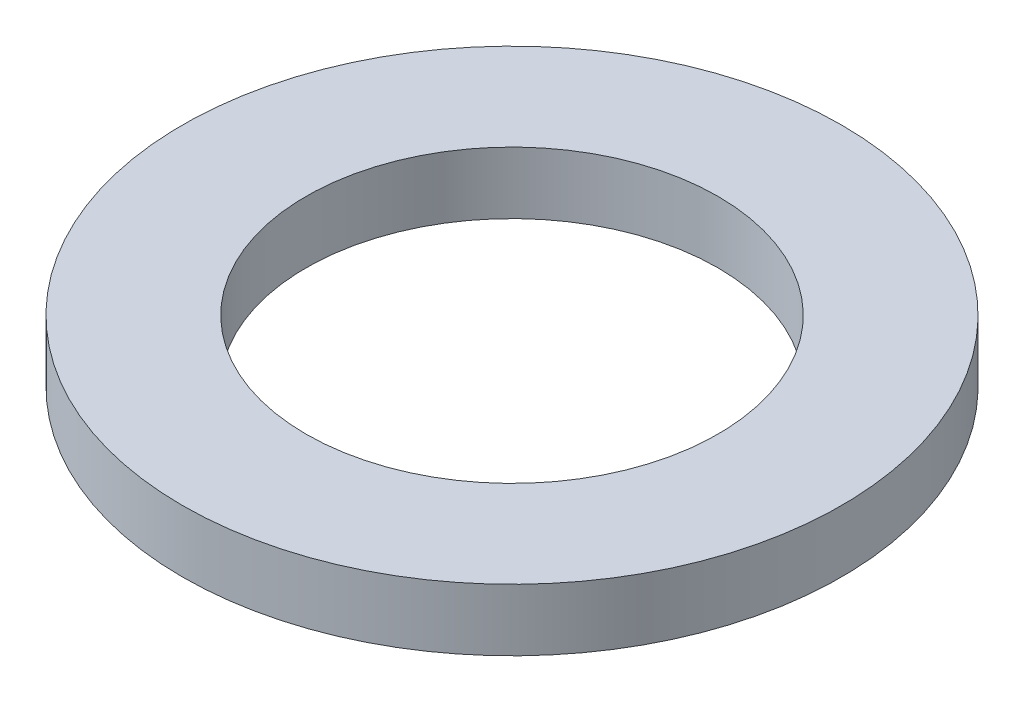
ISO-10303-21;
HEADER;
FILE_DESCRIPTION(('STEP AP214'),'2;1');
FILE_NAME('part.step','',(''),(''),'','','');
FILE_SCHEMA(('AUTOMOTIVE_DESIGN { 1 0 10303 214 1 1 1 1 }'));
ENDSEC;
DATA;
#1=APPLICATION_CONTEXT('core data for automotive mechanical design processes');
#2=APPLICATION_PROTOCOL_DEFINITION('international standard','automotive_design',2000,#1);
#3=PRODUCT_CONTEXT('',#1,'mechanical');
#4=PRODUCT('Part','Part','',(#3));
#5=PRODUCT_RELATED_PRODUCT_CATEGORY('part','',(#4));
#6=PRODUCT_DEFINITION_FORMATION('','',#4);
#7=PRODUCT_DEFINITION_CONTEXT('part definition',#1,'design');
#8=PRODUCT_DEFINITION('design','',#6,#7);
#9=PRODUCT_DEFINITION_SHAPE('','',#8);
#10=(LENGTH_UNIT() NAMED_UNIT(*) SI_UNIT(.MILLI.,.METRE.));
#11=(NAMED_UNIT(*) PLANE_ANGLE_UNIT() SI_UNIT($,.RADIAN.));
#12=(NAMED_UNIT(*) SI_UNIT($,.STERADIAN.) SOLID_ANGLE_UNIT());
#13=UNCERTAINTY_MEASURE_WITH_UNIT(LENGTH_MEASURE(1.E-05),#10,'distance_accuracy_value','');
#14=(GEOMETRIC_REPRESENTATION_CONTEXT(3) GLOBAL_UNCERTAINTY_ASSIGNED_CONTEXT((#13)) GLOBAL_UNIT_ASSIGNED_CONTEXT((#10,
#11,#12)) REPRESENTATION_CONTEXT('',''));
#15=CARTESIAN_POINT('',(0.,0.,0.));
#16=DIRECTION('',(0.,0.,1.));
#17=DIRECTION('',(1.,0.,0.));
#18=AXIS2_PLACEMENT_3D('',#15,#16,#17);
#19=CARTESIAN_POINT('',(0.,2.3876,0.));
#20=DIRECTION('',(0.,1.,0.));
#21=DIRECTION('',(0.,0.,1.));
#22=AXIS2_PLACEMENT_3D('',#19,#20,#21);
#23=PLANE('',#22);
#24=CARTESIAN_POINT('',(0.,2.3876,0.));
#25=DIRECTION('',(0.,1.,0.));
#26=DIRECTION('',(0.,0.,1.));
#27=AXIS2_PLACEMENT_3D('',#24,#25,#26);
#28=CIRCLE('',#27,12.7);
#29=CARTESIAN_POINT('',(0.,2.3876,12.7));
#30=VERTEX_POINT('',#29);
#31=EDGE_CURVE('E10',#30,#30,#28,.T.);
#32=ORIENTED_EDGE('',*,*,#31,.T.);
#33=EDGE_LOOP('',(#32));
#34=FACE_BOUND('',#33,.T.);
#35=CARTESIAN_POINT('',(0.,2.3876,0.));
#36=DIRECTION('',(0.,1.,0.));
#37=DIRECTION('',(0.,0.,1.));
#38=AXIS2_PLACEMENT_3D('',#35,#36,#37);
#39=CIRCLE('',#38,7.9375);
#40=CARTESIAN_POINT('',(0.,2.3876,7.9375));
#41=VERTEX_POINT('',#40);
#42=EDGE_CURVE('E42',#41,#41,#39,.T.);
#43=ORIENTED_EDGE('',*,*,#42,.F.);
#44=EDGE_LOOP('',(#43));
#45=FACE_BOUND('',#44,.T.);
#46=ADVANCED_FACE('F31',(#34,#45),#23,.T.);
#47=CARTESIAN_POINT('',(0.,0.,0.));
#48=DIRECTION('',(0.,1.,0.));
#49=DIRECTION('',(0.,0.,1.));
#50=AXIS2_PLACEMENT_3D('',#47,#48,#49);
#51=PLANE('',#50);
#52=CARTESIAN_POINT('',(0.,0.,0.));
#53=DIRECTION('',(0.,1.,0.));
#54=DIRECTION('',(0.,0.,1.));
#55=AXIS2_PLACEMENT_3D('',#52,#53,#54);
#56=CIRCLE('',#55,12.7);
#57=CARTESIAN_POINT('',(0.,0.,12.7));
#58=VERTEX_POINT('',#57);
#59=EDGE_CURVE('E35',#58,#58,#56,.T.);
#60=ORIENTED_EDGE('',*,*,#59,.F.);
#61=EDGE_LOOP('',(#60));
#62=FACE_BOUND('',#61,.T.);
#63=CARTESIAN_POINT('',(0.,0.,0.));
#64=DIRECTION('',(0.,1.,0.));
#65=DIRECTION('',(0.,0.,1.));
#66=AXIS2_PLACEMENT_3D('',#63,#64,#65);
#67=CIRCLE('',#66,7.9375);
#68=CARTESIAN_POINT('',(0.,0.,7.9375));
#69=VERTEX_POINT('',#68);
#70=EDGE_CURVE('E44',#69,#69,#67,.T.);
#71=ORIENTED_EDGE('',*,*,#70,.T.);
#72=EDGE_LOOP('',(#71));
#73=FACE_BOUND('',#72,.T.);
#74=ADVANCED_FACE('F54',(#62,#73),#51,.F.);
#75=CARTESIAN_POINT('',(0.,2.3876,0.));
#76=DIRECTION('',(0.,-1.,0.));
#77=DIRECTION('',(0.,0.,-1.));
#78=AXIS2_PLACEMENT_3D('',#75,#76,#77);
#79=CYLINDRICAL_SURFACE('',#78,12.7);
#80=ORIENTED_EDGE('',*,*,#31,.F.);
#81=EDGE_LOOP('',(#80));
#82=FACE_BOUND('',#81,.T.);
#83=ORIENTED_EDGE('',*,*,#59,.T.);
#84=EDGE_LOOP('',(#83));
#85=FACE_BOUND('',#84,.T.);
#86=ADVANCED_FACE('F33',(#82,#85),#79,.T.);
#87=CARTESIAN_POINT('',(0.,2.3876,0.));
#88=DIRECTION('',(0.,-1.,0.));
#89=DIRECTION('',(0.,0.,-1.));
#90=AXIS2_PLACEMENT_3D('',#87,#88,#89);
#91=CYLINDRICAL_SURFACE('',#90,7.9375);
#92=ORIENTED_EDGE('',*,*,#42,.T.);
#93=EDGE_LOOP('',(#92));
#94=FACE_BOUND('',#93,.T.);
#95=ORIENTED_EDGE('',*,*,#70,.F.);
#96=EDGE_LOOP('',(#95));
#97=FACE_BOUND('',#96,.T.);
#98=ADVANCED_FACE('F50',(#94,#97),#91,.F.);
#99=CLOSED_SHELL('',(#46,#74,#86,#98));
#100=MANIFOLD_SOLID_BREP('B2',#99);
#101=ADVANCED_BREP_SHAPE_REPRESENTATION('',(#18,#100),#14);
#102=SHAPE_DEFINITION_REPRESENTATION(#9,#101);
ENDSEC;
END-ISO-10303-21;
